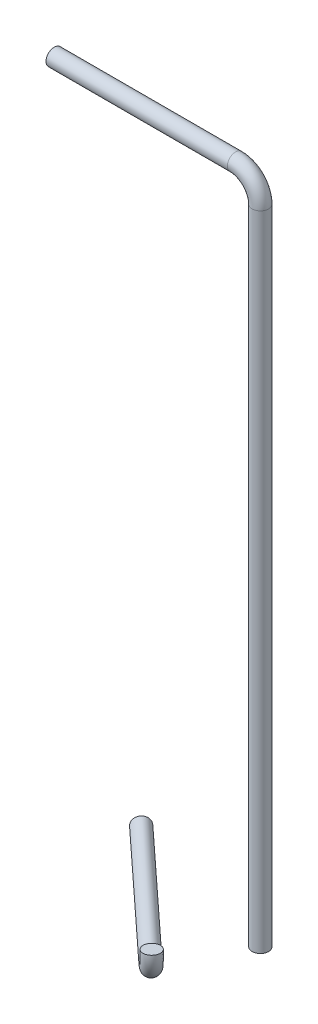
ISO-10303-21;
HEADER;
FILE_DESCRIPTION(('STEP AP214'),'2;1');
FILE_NAME('part.step','',(''),(''),'','','');
FILE_SCHEMA(('AUTOMOTIVE_DESIGN { 1 0 10303 214 1 1 1 1 }'));
ENDSEC;
DATA;
#1=APPLICATION_CONTEXT('core data for automotive mechanical design processes');
#2=APPLICATION_PROTOCOL_DEFINITION('international standard','automotive_design',2000,#1);
#3=PRODUCT_CONTEXT('',#1,'mechanical');
#4=PRODUCT('Part','Part','',(#3));
#5=PRODUCT_RELATED_PRODUCT_CATEGORY('part','',(#4));
#6=PRODUCT_DEFINITION_FORMATION('','',#4);
#7=PRODUCT_DEFINITION_CONTEXT('part definition',#1,'design');
#8=PRODUCT_DEFINITION('design','',#6,#7);
#9=PRODUCT_DEFINITION_SHAPE('','',#8);
#10=(LENGTH_UNIT() NAMED_UNIT(*) SI_UNIT(.MILLI.,.METRE.));
#11=(NAMED_UNIT(*) PLANE_ANGLE_UNIT() SI_UNIT($,.RADIAN.));
#12=(NAMED_UNIT(*) SI_UNIT($,.STERADIAN.) SOLID_ANGLE_UNIT());
#13=UNCERTAINTY_MEASURE_WITH_UNIT(LENGTH_MEASURE(1.E-05),#10,'distance_accuracy_value','');
#14=(GEOMETRIC_REPRESENTATION_CONTEXT(3) GLOBAL_UNCERTAINTY_ASSIGNED_CONTEXT((#13)) GLOBAL_UNIT_ASSIGNED_CONTEXT((#10,
#11,#12)) REPRESENTATION_CONTEXT('',''));
#15=CARTESIAN_POINT('',(0.,0.,0.));
#16=DIRECTION('',(0.,0.,1.));
#17=DIRECTION('',(1.,0.,0.));
#18=AXIS2_PLACEMENT_3D('',#15,#16,#17);
#19=CARTESIAN_POINT('',(18.6706529314785,-81.02,6.84814600856418));
#20=DIRECTION('',(0.0569018909111099,-0.99699365426064,0.0525911415996612));
#21=DIRECTION('',(-0.678742109024723,0.,0.734376708125109));
#22=AXIS2_PLACEMENT_3D('',#19,#20,#21);
#23=PLANE('',#22);
#24=CARTESIAN_POINT('',(18.6706529314785,-81.02,6.84814600856418));
#25=DIRECTION('',(0.0569018909111099,-0.99699365426064,0.0525911415996612));
#26=DIRECTION('',(-0.678742109024723,0.,0.734376708125109));
#27=AXIS2_PLACEMENT_3D('',#24,#25,#26);
#28=CIRCLE('',#27,1.);
#29=CARTESIAN_POINT('',(19.4028218493161,-80.9425167543012,7.52484758414132));
#30=VERTEX_POINT('',#29);
#31=EDGE_CURVE('E49',#30,#30,#28,.T.);
#32=ORIENTED_EDGE('',*,*,#31,.F.);
#33=EDGE_LOOP('',(#32));
#34=FACE_BOUND('',#33,.T.);
#35=ADVANCED_FACE('F39',(#34),#23,.F.);
#36=CARTESIAN_POINT('',(1.78661201546371,-84.2524497370963,-8.75680089866164));
#37=DIRECTION('',(-0.73437670812511,0.,-0.678742109024722));
#38=DIRECTION('',(-0.678742109024722,0.,0.73437670812511));
#39=AXIS2_PLACEMENT_3D('',#36,#37,#38);
#40=PLANE('',#39);
#41=CARTESIAN_POINT('',(1.78661201546371,-84.2524497370963,-8.75680089866164));
#42=DIRECTION('',(-0.73437670812511,0.,-0.678742109024722));
#43=DIRECTION('',(-0.678742109024722,0.,0.73437670812511));
#44=AXIS2_PLACEMENT_3D('',#41,#42,#43);
#45=CIRCLE('',#44,1.);
#46=CARTESIAN_POINT('',(1.10786990643899,-84.2524497370963,-8.02242419053653));
#47=VERTEX_POINT('',#46);
#48=EDGE_CURVE('E11',#47,#47,#45,.T.);
#49=ORIENTED_EDGE('',*,*,#48,.T.);
#50=EDGE_LOOP('',(#49));
#51=FACE_BOUND('',#50,.T.);
#52=ADVANCED_FACE('F59',(#51),#40,.T.);
#53=CARTESIAN_POINT('',(16.4741461779659,-81.2524497370963,4.8180412818328));
#54=DIRECTION('',(0.678742109024722,0.,-0.734376708125109));
#55=DIRECTION('',(-0.734376708125109,0.,-0.678742109024722));
#56=AXIS2_PLACEMENT_3D('',#53,#54,#55);
#57=TOROIDAL_SURFACE('',#56,2.99999999999998,1.);
#58=CARTESIAN_POINT('',(16.4741461779658,-84.2524497370963,4.81804128183269));
#59=DIRECTION('',(-0.73437670812511,0.,-0.678742109024722));
#60=DIRECTION('',(-0.678742109024722,0.,0.73437670812511));
#61=AXIS2_PLACEMENT_3D('',#58,#59,#60);
#62=CIRCLE('',#61,1.);
#63=CARTESIAN_POINT('',(16.4741461779658,-85.2524497370963,4.81804128183265));
#64=VERTEX_POINT('',#63);
#65=EDGE_CURVE('E45',#64,#64,#62,.T.);
#66=CARTESIAN_POINT('',(16.4741461779659,-81.2524497370963,4.8180412818328));
#67=DIRECTION('',(0.678742109024722,0.,-0.734376708125109));
#68=DIRECTION('',(-0.734376708125109,0.,-0.678742109024722));
#69=AXIS2_PLACEMENT_3D('',#66,#67,#68);
#70=CIRCLE('',#69,3.99999999999998);
#71=EDGE_CURVE('',#30,#64,#70,.T.);
#72=ORIENTED_EDGE('',*,*,#31,.T.);
#73=ORIENTED_EDGE('',*,*,#65,.F.);
#74=ORIENTED_EDGE('',*,*,#71,.T.);
#75=ORIENTED_EDGE('',*,*,#71,.F.);
#76=EDGE_LOOP('',(#72,#74,#73,#75));
#77=FACE_BOUND('',#76,.T.);
#78=ADVANCED_FACE('F56',(#77),#57,.T.);
#79=CARTESIAN_POINT('',(16.4741461779659,-84.2524497370963,4.8180412818328));
#80=DIRECTION('',(-0.734376708125109,0.,-0.678742109024722));
#81=DIRECTION('',(-0.678742109024722,0.,0.734376708125109));
#82=AXIS2_PLACEMENT_3D('',#79,#80,#81);
#83=CYLINDRICAL_SURFACE('',#82,1.);
#84=ORIENTED_EDGE('',*,*,#48,.F.);
#85=EDGE_LOOP('',(#84));
#86=FACE_BOUND('',#85,.T.);
#87=ORIENTED_EDGE('',*,*,#65,.T.);
#88=EDGE_LOOP('',(#87));
#89=FACE_BOUND('',#88,.T.);
#90=ADVANCED_FACE('F63',(#86,#89),#83,.T.);
#91=CLOSED_SHELL('',(#35,#52,#78,#90));
#92=MANIFOLD_SOLID_BREP('B2',#91);
#93=CARTESIAN_POINT('',(0.,0.,0.));
#94=DIRECTION('',(1.,0.,0.));
#95=DIRECTION('',(0.,0.,-1.));
#96=AXIS2_PLACEMENT_3D('',#93,#94,#95);
#97=PLANE('',#96);
#98=CARTESIAN_POINT('',(0.,0.,0.));
#99=DIRECTION('',(1.,0.,0.));
#100=DIRECTION('',(0.,0.,-1.));
#101=AXIS2_PLACEMENT_3D('',#98,#99,#100);
#102=CIRCLE('',#101,1.);
#103=CARTESIAN_POINT('',(0.,0.,-1.));
#104=VERTEX_POINT('',#103);
#105=EDGE_CURVE('E109',#104,#104,#102,.T.);
#106=ORIENTED_EDGE('',*,*,#105,.F.);
#107=EDGE_LOOP('',(#106));
#108=FACE_BOUND('',#107,.T.);
#109=ADVANCED_FACE('F95',(#108),#97,.F.);
#110=CARTESIAN_POINT('',(25.,-81.02,0.));
#111=DIRECTION('',(0.,-1.,0.));
#112=DIRECTION('',(0.,0.,-1.));
#113=AXIS2_PLACEMENT_3D('',#110,#111,#112);
#114=PLANE('',#113);
#115=CARTESIAN_POINT('',(25.,-81.02,0.));
#116=DIRECTION('',(0.,-1.,0.));
#117=DIRECTION('',(0.,0.,-1.));
#118=AXIS2_PLACEMENT_3D('',#115,#116,#117);
#119=CIRCLE('',#118,1.);
#120=CARTESIAN_POINT('',(25.,-81.02,-1.));
#121=VERTEX_POINT('',#120);
#122=EDGE_CURVE('E38',#121,#121,#119,.T.);
#123=ORIENTED_EDGE('',*,*,#122,.T.);
#124=EDGE_LOOP('',(#123));
#125=FACE_BOUND('',#124,.T.);
#126=ADVANCED_FACE('F118',(#125),#114,.T.);
#127=CARTESIAN_POINT('',(0.,0.,0.));
#128=DIRECTION('',(1.,0.,0.));
#129=DIRECTION('',(0.,0.,-1.));
#130=AXIS2_PLACEMENT_3D('',#127,#128,#129);
#131=CYLINDRICAL_SURFACE('',#130,1.);
#132=CARTESIAN_POINT('',(22.,0.,0.));
#133=DIRECTION('',(1.,0.,0.));
#134=DIRECTION('',(0.,0.,-1.));
#135=AXIS2_PLACEMENT_3D('',#132,#133,#134);
#136=CIRCLE('',#135,1.);
#137=CARTESIAN_POINT('',(22.,1.,0.));
#138=VERTEX_POINT('',#137);
#139=EDGE_CURVE('E105',#138,#138,#136,.T.);
#140=ORIENTED_EDGE('',*,*,#139,.F.);
#141=EDGE_LOOP('',(#140));
#142=FACE_BOUND('',#141,.T.);
#143=ORIENTED_EDGE('',*,*,#105,.T.);
#144=EDGE_LOOP('',(#143));
#145=FACE_BOUND('',#144,.T.);
#146=ADVANCED_FACE('F115',(#142,#145),#131,.T.);
#147=CARTESIAN_POINT('',(22.,-3.,0.));
#148=DIRECTION('',(0.,0.,-1.));
#149=DIRECTION('',(-1.,0.,0.));
#150=AXIS2_PLACEMENT_3D('',#147,#148,#149);
#151=TOROIDAL_SURFACE('',#150,3.,1.);
#152=CARTESIAN_POINT('',(25.,-3.,0.));
#153=DIRECTION('',(0.,-1.,0.));
#154=DIRECTION('',(0.,0.,-1.));
#155=AXIS2_PLACEMENT_3D('',#152,#153,#154);
#156=CIRCLE('',#155,1.);
#157=CARTESIAN_POINT('',(26.,-3.,0.));
#158=VERTEX_POINT('',#157);
#159=EDGE_CURVE('E101',#158,#158,#156,.T.);
#160=CARTESIAN_POINT('',(22.,-3.,0.));
#161=DIRECTION('',(0.,0.,-1.));
#162=DIRECTION('',(-1.,0.,0.));
#163=AXIS2_PLACEMENT_3D('',#160,#161,#162);
#164=CIRCLE('',#163,4.);
#165=EDGE_CURVE('',#138,#158,#164,.T.);
#166=ORIENTED_EDGE('',*,*,#139,.T.);
#167=ORIENTED_EDGE('',*,*,#159,.F.);
#168=ORIENTED_EDGE('',*,*,#165,.T.);
#169=ORIENTED_EDGE('',*,*,#165,.F.);
#170=EDGE_LOOP('',(#166,#168,#167,#169));
#171=FACE_BOUND('',#170,.T.);
#172=ADVANCED_FACE('F124',(#171),#151,.T.);
#173=CARTESIAN_POINT('',(25.,-3.,0.));
#174=DIRECTION('',(0.,-1.,0.));
#175=DIRECTION('',(1.,0.,0.));
#176=AXIS2_PLACEMENT_3D('',#173,#174,#175);
#177=CYLINDRICAL_SURFACE('',#176,1.);
#178=ORIENTED_EDGE('',*,*,#122,.F.);
#179=EDGE_LOOP('',(#178));
#180=FACE_BOUND('',#179,.T.);
#181=ORIENTED_EDGE('',*,*,#159,.T.);
#182=EDGE_LOOP('',(#181));
#183=FACE_BOUND('',#182,.T.);
#184=ADVANCED_FACE('F122',(#180,#183),#177,.T.);
#185=CLOSED_SHELL('',(#109,#126,#146,#172,#184));
#186=MANIFOLD_SOLID_BREP('B6',#185);
#187=ADVANCED_BREP_SHAPE_REPRESENTATION('',(#18,#92,#186),#14);
#188=SHAPE_DEFINITION_REPRESENTATION(#9,#187);
ENDSEC;
END-ISO-10303-21;
